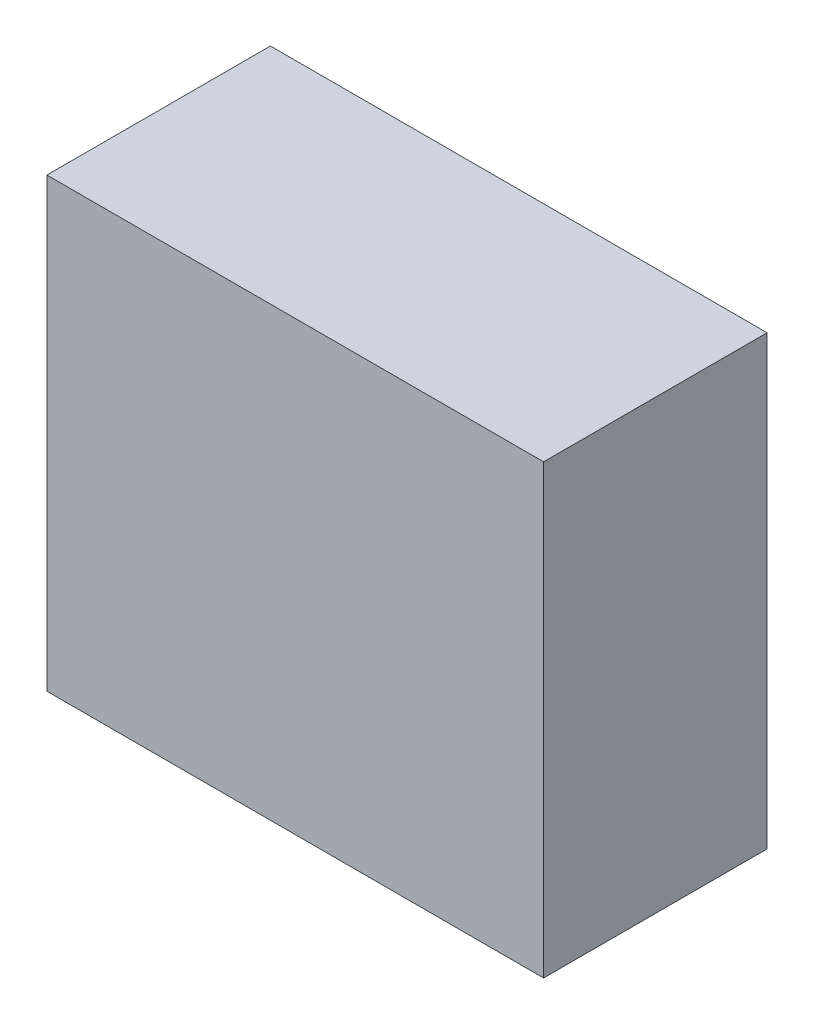
ISO-10303-21;
HEADER;
FILE_DESCRIPTION(('STEP AP214'),'2;1');
FILE_NAME('part.step','',(''),(''),'','','');
FILE_SCHEMA(('AUTOMOTIVE_DESIGN { 1 0 10303 214 1 1 1 1 }'));
ENDSEC;
DATA;
#1=APPLICATION_CONTEXT('core data for automotive mechanical design processes');
#2=APPLICATION_PROTOCOL_DEFINITION('international standard','automotive_design',2000,#1);
#3=PRODUCT_CONTEXT('',#1,'mechanical');
#4=PRODUCT('Part','Part','',(#3));
#5=PRODUCT_RELATED_PRODUCT_CATEGORY('part','',(#4));
#6=PRODUCT_DEFINITION_FORMATION('','',#4);
#7=PRODUCT_DEFINITION_CONTEXT('part definition',#1,'design');
#8=PRODUCT_DEFINITION('design','',#6,#7);
#9=PRODUCT_DEFINITION_SHAPE('','',#8);
#10=(LENGTH_UNIT() NAMED_UNIT(*) SI_UNIT(.MILLI.,.METRE.));
#11=(NAMED_UNIT(*) PLANE_ANGLE_UNIT() SI_UNIT($,.RADIAN.));
#12=(NAMED_UNIT(*) SI_UNIT($,.STERADIAN.) SOLID_ANGLE_UNIT());
#13=UNCERTAINTY_MEASURE_WITH_UNIT(LENGTH_MEASURE(1.E-05),#10,'distance_accuracy_value','');
#14=(GEOMETRIC_REPRESENTATION_CONTEXT(3) GLOBAL_UNCERTAINTY_ASSIGNED_CONTEXT((#13)) GLOBAL_UNIT_ASSIGNED_CONTEXT((#10,
#11,#12)) REPRESENTATION_CONTEXT('',''));
#15=CARTESIAN_POINT('',(0.,0.,0.));
#16=DIRECTION('',(0.,0.,1.));
#17=DIRECTION('',(1.,0.,0.));
#18=AXIS2_PLACEMENT_3D('',#15,#16,#17);
#19=CARTESIAN_POINT('',(0.499999,-0.45000164,0.4499991));
#20=DIRECTION('',(0.,0.,-1.));
#21=DIRECTION('',(-1.,0.,0.));
#22=AXIS2_PLACEMENT_3D('',#19,#20,#21);
#23=PLANE('',#22);
#24=DIRECTION('',(1.,0.,0.));
#25=VECTOR('',#24,1.);
#26=CARTESIAN_POINT('',(0.499999,0.45000164,0.4499991));
#27=LINE('',#26,#25);
#28=CARTESIAN_POINT('',(0.499999,0.45000164,0.4499991));
#29=VERTEX_POINT('',#28);
#30=CARTESIAN_POINT('',(-0.499999,0.45000164,0.4499991));
#31=VERTEX_POINT('',#30);
#32=EDGE_CURVE('E54',#29,#31,#27,.F.);
#33=ORIENTED_EDGE('',*,*,#32,.T.);
#34=DIRECTION('',(0.,1.,0.));
#35=VECTOR('',#34,1.);
#36=CARTESIAN_POINT('',(-0.499999,0.45000164,0.4499991));
#37=LINE('',#36,#35);
#38=CARTESIAN_POINT('',(-0.499999,-0.45000164,0.4499991));
#39=VERTEX_POINT('',#38);
#40=EDGE_CURVE('E56',#31,#39,#37,.F.);
#41=ORIENTED_EDGE('',*,*,#40,.T.);
#42=DIRECTION('',(1.,0.,0.));
#43=VECTOR('',#42,1.);
#44=CARTESIAN_POINT('',(-0.499999,-0.45000164,0.4499991));
#45=LINE('',#44,#43);
#46=CARTESIAN_POINT('',(0.499999,-0.45000164,0.4499991));
#47=VERTEX_POINT('',#46);
#48=EDGE_CURVE('E19',#39,#47,#45,.T.);
#49=ORIENTED_EDGE('',*,*,#48,.T.);
#50=DIRECTION('',(0.,1.,0.));
#51=VECTOR('',#50,1.);
#52=CARTESIAN_POINT('',(0.499999,-0.45000164,0.4499991));
#53=LINE('',#52,#51);
#54=EDGE_CURVE('E79',#47,#29,#53,.T.);
#55=ORIENTED_EDGE('',*,*,#54,.T.);
#56=EDGE_LOOP('',(#33,#41,#49,#55));
#57=FACE_BOUND('',#56,.T.);
#58=ADVANCED_FACE('F16',(#57),#23,.F.);
#59=CARTESIAN_POINT('',(-0.499999,-0.45000164,0.));
#60=DIRECTION('',(0.,1.,0.));
#61=DIRECTION('',(0.,0.,1.));
#62=AXIS2_PLACEMENT_3D('',#59,#60,#61);
#63=PLANE('',#62);
#64=DIRECTION('',(0.,0.,1.));
#65=VECTOR('',#64,1.);
#66=CARTESIAN_POINT('',(0.499999,-0.45000164,0.));
#67=LINE('',#66,#65);
#68=CARTESIAN_POINT('',(0.499999,-0.45000164,0.));
#69=VERTEX_POINT('',#68);
#70=EDGE_CURVE('E67',#69,#47,#67,.T.);
#71=ORIENTED_EDGE('',*,*,#70,.T.);
#72=ORIENTED_EDGE('',*,*,#48,.F.);
#73=DIRECTION('',(0.,0.,-1.));
#74=VECTOR('',#73,1.);
#75=CARTESIAN_POINT('',(-0.499999,-0.45000164,0.));
#76=LINE('',#75,#74);
#77=CARTESIAN_POINT('',(-0.499999,-0.45000164,0.));
#78=VERTEX_POINT('',#77);
#79=EDGE_CURVE('E62',#39,#78,#76,.T.);
#80=ORIENTED_EDGE('',*,*,#79,.T.);
#81=DIRECTION('',(-1.,0.,0.));
#82=VECTOR('',#81,1.);
#83=CARTESIAN_POINT('',(0.499999,-0.45000164,0.));
#84=LINE('',#83,#82);
#85=EDGE_CURVE('E82',#69,#78,#84,.T.);
#86=ORIENTED_EDGE('',*,*,#85,.F.);
#87=EDGE_LOOP('',(#71,#72,#80,#86));
#88=FACE_BOUND('',#87,.T.);
#89=ADVANCED_FACE('F64',(#88),#63,.F.);
#90=CARTESIAN_POINT('',(-0.499999,0.45000164,0.));
#91=DIRECTION('',(1.,0.,0.));
#92=DIRECTION('',(0.,0.,-1.));
#93=AXIS2_PLACEMENT_3D('',#90,#91,#92);
#94=PLANE('',#93);
#95=ORIENTED_EDGE('',*,*,#79,.F.);
#96=ORIENTED_EDGE('',*,*,#40,.F.);
#97=DIRECTION('',(0.,0.,-1.));
#98=VECTOR('',#97,1.);
#99=CARTESIAN_POINT('',(-0.499999,0.45000164,0.));
#100=LINE('',#99,#98);
#101=CARTESIAN_POINT('',(-0.499999,0.45000164,0.));
#102=VERTEX_POINT('',#101);
#103=EDGE_CURVE('E74',#31,#102,#100,.T.);
#104=ORIENTED_EDGE('',*,*,#103,.T.);
#105=DIRECTION('',(0.,1.,0.));
#106=VECTOR('',#105,1.);
#107=CARTESIAN_POINT('',(-0.499999,-0.45000164,0.));
#108=LINE('',#107,#106);
#109=EDGE_CURVE('E71',#78,#102,#108,.T.);
#110=ORIENTED_EDGE('',*,*,#109,.F.);
#111=EDGE_LOOP('',(#95,#96,#104,#110));
#112=FACE_BOUND('',#111,.T.);
#113=ADVANCED_FACE('F69',(#112),#94,.F.);
#114=CARTESIAN_POINT('',(0.499999,0.45000164,0.));
#115=DIRECTION('',(0.,-1.,0.));
#116=DIRECTION('',(0.,0.,-1.));
#117=AXIS2_PLACEMENT_3D('',#114,#115,#116);
#118=PLANE('',#117);
#119=ORIENTED_EDGE('',*,*,#103,.F.);
#120=ORIENTED_EDGE('',*,*,#32,.F.);
#121=DIRECTION('',(0.,0.,1.));
#122=VECTOR('',#121,1.);
#123=CARTESIAN_POINT('',(0.499999,0.45000164,0.));
#124=LINE('',#123,#122);
#125=CARTESIAN_POINT('',(0.499999,0.45000164,0.));
#126=VERTEX_POINT('',#125);
#127=EDGE_CURVE('E34',#29,#126,#124,.F.);
#128=ORIENTED_EDGE('',*,*,#127,.T.);
#129=DIRECTION('',(-1.,0.,0.));
#130=VECTOR('',#129,1.);
#131=CARTESIAN_POINT('',(0.499999,0.45000164,0.));
#132=LINE('',#131,#130);
#133=EDGE_CURVE('E25',#102,#126,#132,.F.);
#134=ORIENTED_EDGE('',*,*,#133,.F.);
#135=EDGE_LOOP('',(#119,#120,#128,#134));
#136=FACE_BOUND('',#135,.T.);
#137=ADVANCED_FACE('F88',(#136),#118,.F.);
#138=CARTESIAN_POINT('',(0.499999,-0.45000164,0.));
#139=DIRECTION('',(-1.,0.,0.));
#140=DIRECTION('',(0.,0.,1.));
#141=AXIS2_PLACEMENT_3D('',#138,#139,#140);
#142=PLANE('',#141);
#143=ORIENTED_EDGE('',*,*,#127,.F.);
#144=ORIENTED_EDGE('',*,*,#54,.F.);
#145=ORIENTED_EDGE('',*,*,#70,.F.);
#146=DIRECTION('',(0.,1.,0.));
#147=VECTOR('',#146,1.);
#148=CARTESIAN_POINT('',(0.499999,-0.45000164,0.));
#149=LINE('',#148,#147);
#150=EDGE_CURVE('E11',#126,#69,#149,.F.);
#151=ORIENTED_EDGE('',*,*,#150,.F.);
#152=EDGE_LOOP('',(#143,#144,#145,#151));
#153=FACE_BOUND('',#152,.T.);
#154=ADVANCED_FACE('F90',(#153),#142,.F.);
#155=CARTESIAN_POINT('',(0.499999,-0.45000164,0.));
#156=DIRECTION('',(0.,0.,-1.));
#157=DIRECTION('',(-1.,0.,0.));
#158=AXIS2_PLACEMENT_3D('',#155,#156,#157);
#159=PLANE('',#158);
#160=ORIENTED_EDGE('',*,*,#133,.T.);
#161=ORIENTED_EDGE('',*,*,#150,.T.);
#162=ORIENTED_EDGE('',*,*,#85,.T.);
#163=ORIENTED_EDGE('',*,*,#109,.T.);
#164=EDGE_LOOP('',(#160,#161,#162,#163));
#165=FACE_BOUND('',#164,.T.);
#166=ADVANCED_FACE('F87',(#165),#159,.T.);
#167=CLOSED_SHELL('',(#58,#89,#113,#137,#154,#166));
#168=MANIFOLD_SOLID_BREP('B1',#167);
#169=ADVANCED_BREP_SHAPE_REPRESENTATION('',(#18,#168),#14);
#170=SHAPE_DEFINITION_REPRESENTATION(#9,#169);
ENDSEC;
END-ISO-10303-21;
